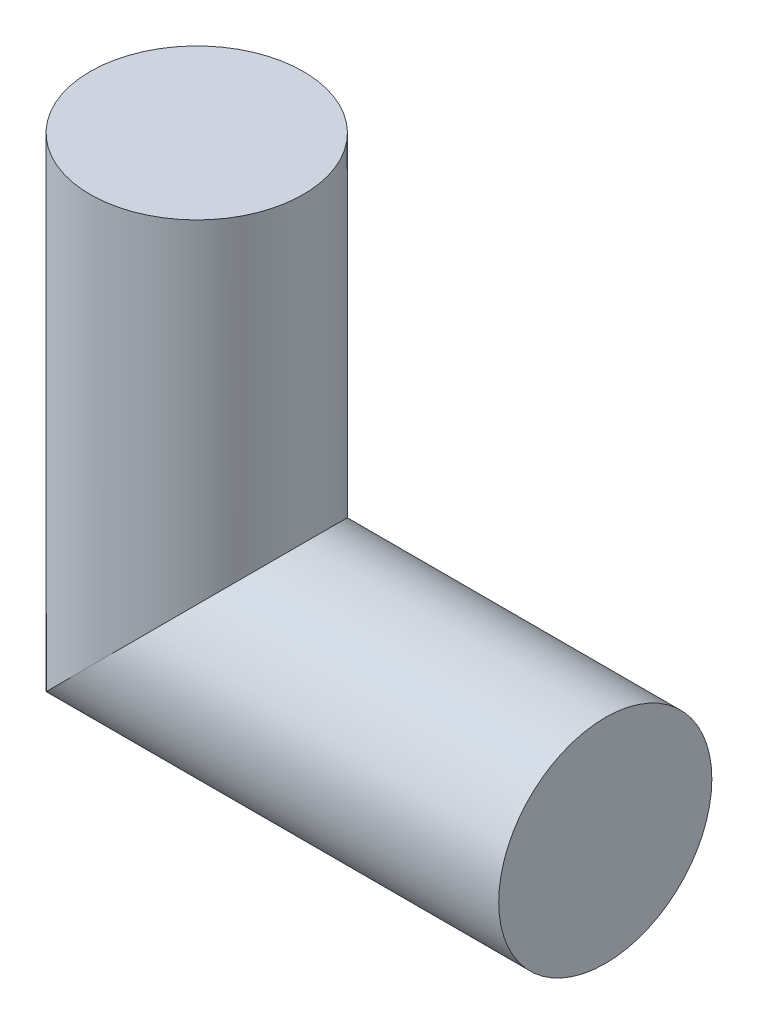
ISO-10303-21;
HEADER;
FILE_DESCRIPTION(('STEP AP214'),'2;1');
FILE_NAME('part.step','',(''),(''),'','','');
FILE_SCHEMA(('AUTOMOTIVE_DESIGN { 1 0 10303 214 1 1 1 1 }'));
ENDSEC;
DATA;
#1=APPLICATION_CONTEXT('core data for automotive mechanical design processes');
#2=APPLICATION_PROTOCOL_DEFINITION('international standard','automotive_design',2000,#1);
#3=PRODUCT_CONTEXT('',#1,'mechanical');
#4=PRODUCT('Part','Part','',(#3));
#5=PRODUCT_RELATED_PRODUCT_CATEGORY('part','',(#4));
#6=PRODUCT_DEFINITION_FORMATION('','',#4);
#7=PRODUCT_DEFINITION_CONTEXT('part definition',#1,'design');
#8=PRODUCT_DEFINITION('design','',#6,#7);
#9=PRODUCT_DEFINITION_SHAPE('','',#8);
#10=(LENGTH_UNIT() NAMED_UNIT(*) SI_UNIT(.MILLI.,.METRE.));
#11=(NAMED_UNIT(*) PLANE_ANGLE_UNIT() SI_UNIT($,.RADIAN.));
#12=(NAMED_UNIT(*) SI_UNIT($,.STERADIAN.) SOLID_ANGLE_UNIT());
#13=UNCERTAINTY_MEASURE_WITH_UNIT(LENGTH_MEASURE(1.E-05),#10,'distance_accuracy_value','');
#14=(GEOMETRIC_REPRESENTATION_CONTEXT(3) GLOBAL_UNCERTAINTY_ASSIGNED_CONTEXT((#13)) GLOBAL_UNIT_ASSIGNED_CONTEXT((#10,
#11,#12)) REPRESENTATION_CONTEXT('',''));
#15=CARTESIAN_POINT('',(0.,0.,0.));
#16=DIRECTION('',(0.,0.,1.));
#17=DIRECTION('',(1.,0.,0.));
#18=AXIS2_PLACEMENT_3D('',#15,#16,#17);
#19=CARTESIAN_POINT('',(-23.,0.,0.));
#20=DIRECTION('',(0.,1.,0.));
#21=DIRECTION('',(-1.,0.,0.));
#22=AXIS2_PLACEMENT_3D('',#19,#20,#21);
#23=CYLINDRICAL_SURFACE('',#22,6.00000000000001);
#24=CARTESIAN_POINT('',(-23.,0.,0.));
#25=DIRECTION('',(-0.707106781186547,0.707106781186548,0.));
#26=DIRECTION('',(0.707106781186548,0.707106781186547,0.));
#27=AXIS2_PLACEMENT_3D('',#24,#25,#26);
#28=ELLIPSE('',#27,8.48528137423858,6.00000000000001);
#29=CARTESIAN_POINT('',(-17.,6.,0.));
#30=VERTEX_POINT('',#29);
#31=EDGE_CURVE('E40',#30,#30,#28,.F.);
#32=ORIENTED_EDGE('',*,*,#31,.F.);
#33=EDGE_LOOP('',(#32));
#34=FACE_BOUND('',#33,.T.);
#35=CARTESIAN_POINT('',(-23.,23.,0.));
#36=DIRECTION('',(0.,1.,0.));
#37=DIRECTION('',(-1.,0.,0.));
#38=AXIS2_PLACEMENT_3D('',#35,#36,#37);
#39=CIRCLE('',#38,6.00000000000001);
#40=CARTESIAN_POINT('',(-29.,23.,0.));
#41=VERTEX_POINT('',#40);
#42=EDGE_CURVE('E11',#41,#41,#39,.T.);
#43=ORIENTED_EDGE('',*,*,#42,.F.);
#44=EDGE_LOOP('',(#43));
#45=FACE_BOUND('',#44,.T.);
#46=ADVANCED_FACE('F34',(#34,#45),#23,.T.);
#47=CARTESIAN_POINT('',(0.,0.,0.));
#48=DIRECTION('',(1.,0.,0.));
#49=DIRECTION('',(0.,0.,-1.));
#50=AXIS2_PLACEMENT_3D('',#47,#48,#49);
#51=PLANE('',#50);
#52=CARTESIAN_POINT('',(0.,0.,0.));
#53=DIRECTION('',(1.,0.,0.));
#54=DIRECTION('',(0.,0.,-1.));
#55=AXIS2_PLACEMENT_3D('',#52,#53,#54);
#56=CIRCLE('',#55,6.00000000000001);
#57=CARTESIAN_POINT('',(0.,0.,-6.00000000000001));
#58=VERTEX_POINT('',#57);
#59=EDGE_CURVE('E44',#58,#58,#56,.T.);
#60=ORIENTED_EDGE('',*,*,#59,.T.);
#61=EDGE_LOOP('',(#60));
#62=FACE_BOUND('',#61,.T.);
#63=ADVANCED_FACE('F51',(#62),#51,.T.);
#64=CARTESIAN_POINT('',(-39.9705627484772,0.,0.));
#65=DIRECTION('',(1.,0.,0.));
#66=DIRECTION('',(0.,1.,0.));
#67=AXIS2_PLACEMENT_3D('',#64,#65,#66);
#68=CYLINDRICAL_SURFACE('',#67,6.00000000000001);
#69=ORIENTED_EDGE('',*,*,#59,.F.);
#70=EDGE_LOOP('',(#69));
#71=FACE_BOUND('',#70,.T.);
#72=ORIENTED_EDGE('',*,*,#31,.T.);
#73=EDGE_LOOP('',(#72));
#74=FACE_BOUND('',#73,.T.);
#75=ADVANCED_FACE('F53',(#71,#74),#68,.T.);
#76=CARTESIAN_POINT('',(-23.,23.,0.));
#77=DIRECTION('',(0.,1.,0.));
#78=DIRECTION('',(-1.,0.,0.));
#79=AXIS2_PLACEMENT_3D('',#76,#77,#78);
#80=PLANE('',#79);
#81=ORIENTED_EDGE('',*,*,#42,.T.);
#82=EDGE_LOOP('',(#81));
#83=FACE_BOUND('',#82,.T.);
#84=ADVANCED_FACE('F55',(#83),#80,.T.);
#85=CLOSED_SHELL('',(#46,#63,#75,#84));
#86=MANIFOLD_SOLID_BREP('B2',#85);
#87=ADVANCED_BREP_SHAPE_REPRESENTATION('',(#18,#86),#14);
#88=SHAPE_DEFINITION_REPRESENTATION(#9,#87);
ENDSEC;
END-ISO-10303-21;
